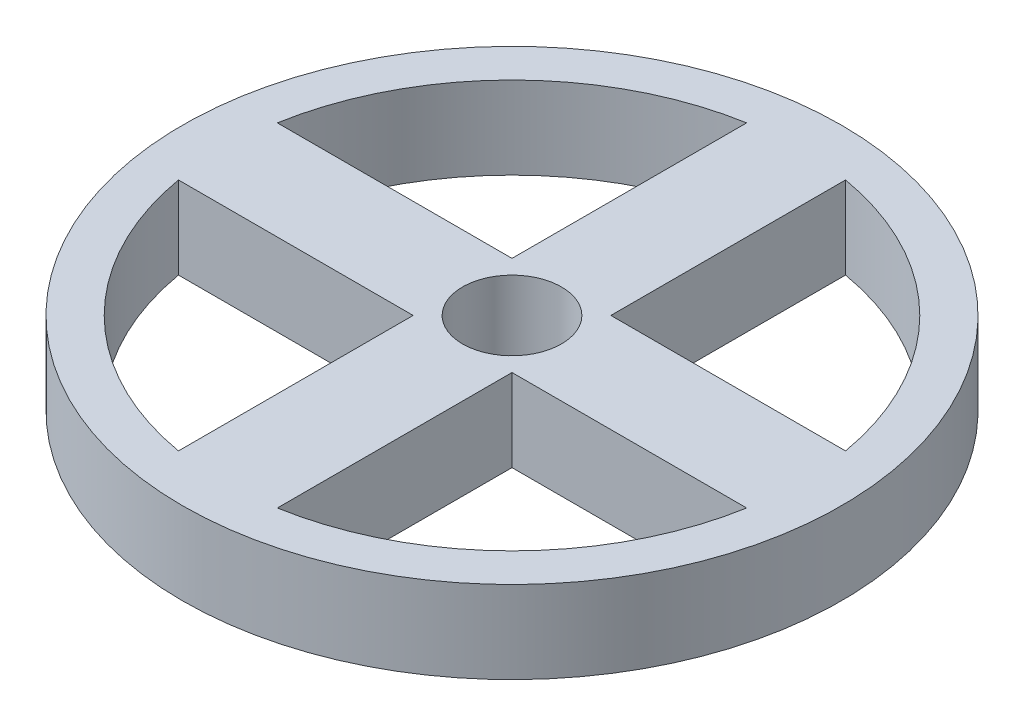
ISO-10303-21;
HEADER;
FILE_DESCRIPTION(('STEP AP214'),'2;1');
FILE_NAME('part.step','',(''),(''),'','','');
FILE_SCHEMA(('AUTOMOTIVE_DESIGN { 1 0 10303 214 1 1 1 1 }'));
ENDSEC;
DATA;
#1=APPLICATION_CONTEXT('core data for automotive mechanical design processes');
#2=APPLICATION_PROTOCOL_DEFINITION('international standard','automotive_design',2000,#1);
#3=PRODUCT_CONTEXT('',#1,'mechanical');
#4=PRODUCT('Part','Part','',(#3));
#5=PRODUCT_RELATED_PRODUCT_CATEGORY('part','',(#4));
#6=PRODUCT_DEFINITION_FORMATION('','',#4);
#7=PRODUCT_DEFINITION_CONTEXT('part definition',#1,'design');
#8=PRODUCT_DEFINITION('design','',#6,#7);
#9=PRODUCT_DEFINITION_SHAPE('','',#8);
#10=(LENGTH_UNIT() NAMED_UNIT(*) SI_UNIT(.MILLI.,.METRE.));
#11=(NAMED_UNIT(*) PLANE_ANGLE_UNIT() SI_UNIT($,.RADIAN.));
#12=(NAMED_UNIT(*) SI_UNIT($,.STERADIAN.) SOLID_ANGLE_UNIT());
#13=UNCERTAINTY_MEASURE_WITH_UNIT(LENGTH_MEASURE(1.E-05),#10,'distance_accuracy_value','');
#14=(GEOMETRIC_REPRESENTATION_CONTEXT(3) GLOBAL_UNCERTAINTY_ASSIGNED_CONTEXT((#13)) GLOBAL_UNIT_ASSIGNED_CONTEXT((#10,
#11,#12)) REPRESENTATION_CONTEXT('',''));
#15=CARTESIAN_POINT('',(0.,0.,0.));
#16=DIRECTION('',(0.,0.,1.));
#17=DIRECTION('',(1.,0.,0.));
#18=AXIS2_PLACEMENT_3D('',#15,#16,#17);
#19=CARTESIAN_POINT('',(0.,10.,0.));
#20=DIRECTION('',(0.,-1.,0.));
#21=DIRECTION('',(0.,0.,-1.));
#22=AXIS2_PLACEMENT_3D('',#19,#20,#21);
#23=CYLINDRICAL_SURFACE('',#22,35.);
#24=CARTESIAN_POINT('',(0.,0.,0.));
#25=DIRECTION('',(0.,1.,0.));
#26=DIRECTION('',(0.,0.,1.));
#27=AXIS2_PLACEMENT_3D('',#24,#25,#26);
#28=CIRCLE('',#27,35.);
#29=CARTESIAN_POINT('',(6.,0.,34.4818792991333));
#30=VERTEX_POINT('',#29);
#31=CARTESIAN_POINT('',(34.4818792991333,0.,6.));
#32=VERTEX_POINT('',#31);
#33=EDGE_CURVE('E140',#30,#32,#28,.T.);
#34=ORIENTED_EDGE('',*,*,#33,.F.);
#35=DIRECTION('',(0.,-1.,0.));
#36=VECTOR('',#35,1.);
#37=CARTESIAN_POINT('',(6.,10.,34.4818792991333));
#38=LINE('',#37,#36);
#39=CARTESIAN_POINT('',(6.,10.,34.4818792991333));
#40=VERTEX_POINT('',#39);
#41=EDGE_CURVE('E11',#40,#30,#38,.T.);
#42=ORIENTED_EDGE('',*,*,#41,.F.);
#43=CARTESIAN_POINT('',(0.,10.,0.));
#44=DIRECTION('',(0.,1.,0.));
#45=DIRECTION('',(0.,0.,1.));
#46=AXIS2_PLACEMENT_3D('',#43,#44,#45);
#47=CIRCLE('',#46,35.);
#48=CARTESIAN_POINT('',(34.4818792991333,10.,6.));
#49=VERTEX_POINT('',#48);
#50=EDGE_CURVE('E138',#40,#49,#47,.T.);
#51=ORIENTED_EDGE('',*,*,#50,.T.);
#52=DIRECTION('',(0.,-1.,0.));
#53=VECTOR('',#52,1.);
#54=CARTESIAN_POINT('',(34.4818792991333,10.,6.));
#55=LINE('',#54,#53);
#56=EDGE_CURVE('E106',#49,#32,#55,.T.);
#57=ORIENTED_EDGE('',*,*,#56,.T.);
#58=EDGE_LOOP('',(#34,#42,#51,#57));
#59=FACE_BOUND('',#58,.T.);
#60=ADVANCED_FACE('F41',(#59),#23,.F.);
#61=CARTESIAN_POINT('',(6.,10.,0.));
#62=DIRECTION('',(1.,0.,0.));
#63=DIRECTION('',(0.,0.,-1.));
#64=AXIS2_PLACEMENT_3D('',#61,#62,#63);
#65=PLANE('',#64);
#66=DIRECTION('',(0.,0.,1.));
#67=VECTOR('',#66,1.);
#68=CARTESIAN_POINT('',(6.,0.,0.));
#69=LINE('',#68,#67);
#70=CARTESIAN_POINT('',(6.,0.,6.));
#71=VERTEX_POINT('',#70);
#72=EDGE_CURVE('E200',#71,#30,#69,.T.);
#73=ORIENTED_EDGE('',*,*,#72,.F.);
#74=DIRECTION('',(0.,-1.,0.));
#75=VECTOR('',#74,1.);
#76=CARTESIAN_POINT('',(6.,10.,6.));
#77=LINE('',#76,#75);
#78=CARTESIAN_POINT('',(6.,10.,6.));
#79=VERTEX_POINT('',#78);
#80=EDGE_CURVE('E52',#79,#71,#77,.T.);
#81=ORIENTED_EDGE('',*,*,#80,.F.);
#82=DIRECTION('',(0.,0.,1.));
#83=VECTOR('',#82,1.);
#84=CARTESIAN_POINT('',(6.,10.,0.));
#85=LINE('',#84,#83);
#86=EDGE_CURVE('E147',#79,#40,#85,.T.);
#87=ORIENTED_EDGE('',*,*,#86,.T.);
#88=ORIENTED_EDGE('',*,*,#41,.T.);
#89=EDGE_LOOP('',(#73,#81,#87,#88));
#90=FACE_BOUND('',#89,.T.);
#91=ADVANCED_FACE('F152',(#90),#65,.T.);
#92=CARTESIAN_POINT('',(0.,10.,-6.));
#93=DIRECTION('',(0.,0.,-1.));
#94=DIRECTION('',(-1.,0.,0.));
#95=AXIS2_PLACEMENT_3D('',#92,#93,#94);
#96=PLANE('',#95);
#97=DIRECTION('',(1.,0.,0.));
#98=VECTOR('',#97,1.);
#99=CARTESIAN_POINT('',(0.,0.,-6.));
#100=LINE('',#99,#98);
#101=CARTESIAN_POINT('',(6.,0.,-6.));
#102=VERTEX_POINT('',#101);
#103=CARTESIAN_POINT('',(34.4818792991333,0.,-6.));
#104=VERTEX_POINT('',#103);
#105=EDGE_CURVE('E191',#102,#104,#100,.T.);
#106=ORIENTED_EDGE('',*,*,#105,.F.);
#107=DIRECTION('',(0.,-1.,0.));
#108=VECTOR('',#107,1.);
#109=CARTESIAN_POINT('',(6.,10.,-6.));
#110=LINE('',#109,#108);
#111=CARTESIAN_POINT('',(6.,10.,-6.));
#112=VERTEX_POINT('',#111);
#113=EDGE_CURVE('E213',#112,#102,#110,.T.);
#114=ORIENTED_EDGE('',*,*,#113,.F.);
#115=DIRECTION('',(1.,0.,0.));
#116=VECTOR('',#115,1.);
#117=CARTESIAN_POINT('',(0.,10.,-6.));
#118=LINE('',#117,#116);
#119=CARTESIAN_POINT('',(34.4818792991333,10.,-6.));
#120=VERTEX_POINT('',#119);
#121=EDGE_CURVE('E265',#112,#120,#118,.T.);
#122=ORIENTED_EDGE('',*,*,#121,.T.);
#123=DIRECTION('',(0.,-1.,0.));
#124=VECTOR('',#123,1.);
#125=CARTESIAN_POINT('',(34.4818792991333,10.,-6.));
#126=LINE('',#125,#124);
#127=EDGE_CURVE('E216',#120,#104,#126,.T.);
#128=ORIENTED_EDGE('',*,*,#127,.T.);
#129=EDGE_LOOP('',(#106,#114,#122,#128));
#130=FACE_BOUND('',#129,.T.);
#131=ADVANCED_FACE('F322',(#130),#96,.T.);
#132=CARTESIAN_POINT('',(6.,10.,0.));
#133=DIRECTION('',(-1.,0.,0.));
#134=DIRECTION('',(0.,0.,1.));
#135=AXIS2_PLACEMENT_3D('',#132,#133,#134);
#136=PLANE('',#135);
#137=DIRECTION('',(0.,0.,-1.));
#138=VECTOR('',#137,1.);
#139=CARTESIAN_POINT('',(6.,0.,0.));
#140=LINE('',#139,#138);
#141=CARTESIAN_POINT('',(6.,0.,-34.4818792991333));
#142=VERTEX_POINT('',#141);
#143=EDGE_CURVE('E195',#102,#142,#140,.T.);
#144=ORIENTED_EDGE('',*,*,#143,.T.);
#145=DIRECTION('',(0.,-1.,0.));
#146=VECTOR('',#145,1.);
#147=CARTESIAN_POINT('',(6.,10.,-34.4818792991333));
#148=LINE('',#147,#146);
#149=CARTESIAN_POINT('',(6.,10.,-34.4818792991333));
#150=VERTEX_POINT('',#149);
#151=EDGE_CURVE('E219',#150,#142,#148,.T.);
#152=ORIENTED_EDGE('',*,*,#151,.F.);
#153=DIRECTION('',(0.,0.,-1.));
#154=VECTOR('',#153,1.);
#155=CARTESIAN_POINT('',(6.,10.,0.));
#156=LINE('',#155,#154);
#157=EDGE_CURVE('E159',#112,#150,#156,.T.);
#158=ORIENTED_EDGE('',*,*,#157,.F.);
#159=ORIENTED_EDGE('',*,*,#113,.T.);
#160=EDGE_LOOP('',(#144,#152,#158,#159));
#161=FACE_BOUND('',#160,.T.);
#162=ADVANCED_FACE('F282',(#161),#136,.F.);
#163=CARTESIAN_POINT('',(-6.,10.,0.));
#164=DIRECTION('',(-1.,0.,0.));
#165=DIRECTION('',(0.,0.,1.));
#166=AXIS2_PLACEMENT_3D('',#163,#164,#165);
#167=PLANE('',#166);
#168=DIRECTION('',(0.,0.,-1.));
#169=VECTOR('',#168,1.);
#170=CARTESIAN_POINT('',(-6.,0.,0.));
#171=LINE('',#170,#169);
#172=CARTESIAN_POINT('',(-6.,0.,-6.));
#173=VERTEX_POINT('',#172);
#174=CARTESIAN_POINT('',(-6.,0.,-34.4818792991333));
#175=VERTEX_POINT('',#174);
#176=EDGE_CURVE('E182',#173,#175,#171,.T.);
#177=ORIENTED_EDGE('',*,*,#176,.F.);
#178=DIRECTION('',(0.,-1.,0.));
#179=VECTOR('',#178,1.);
#180=CARTESIAN_POINT('',(-6.,10.,-6.));
#181=LINE('',#180,#179);
#182=CARTESIAN_POINT('',(-6.,10.,-6.));
#183=VERTEX_POINT('',#182);
#184=EDGE_CURVE('E220',#183,#173,#181,.T.);
#185=ORIENTED_EDGE('',*,*,#184,.F.);
#186=DIRECTION('',(0.,0.,-1.));
#187=VECTOR('',#186,1.);
#188=CARTESIAN_POINT('',(-6.,10.,0.));
#189=LINE('',#188,#187);
#190=CARTESIAN_POINT('',(-6.,10.,-34.4818792991333));
#191=VERTEX_POINT('',#190);
#192=EDGE_CURVE('E255',#183,#191,#189,.T.);
#193=ORIENTED_EDGE('',*,*,#192,.T.);
#194=DIRECTION('',(0.,-1.,0.));
#195=VECTOR('',#194,1.);
#196=CARTESIAN_POINT('',(-6.,10.,-34.4818792991333));
#197=LINE('',#196,#195);
#198=EDGE_CURVE('E225',#191,#175,#197,.T.);
#199=ORIENTED_EDGE('',*,*,#198,.T.);
#200=EDGE_LOOP('',(#177,#185,#193,#199));
#201=FACE_BOUND('',#200,.T.);
#202=ADVANCED_FACE('F302',(#201),#167,.T.);
#203=CARTESIAN_POINT('',(0.,10.,-6.));
#204=DIRECTION('',(0.,0.,1.));
#205=DIRECTION('',(1.,0.,0.));
#206=AXIS2_PLACEMENT_3D('',#203,#204,#205);
#207=PLANE('',#206);
#208=DIRECTION('',(-1.,0.,0.));
#209=VECTOR('',#208,1.);
#210=CARTESIAN_POINT('',(0.,0.,-6.));
#211=LINE('',#210,#209);
#212=CARTESIAN_POINT('',(-34.4818792991333,0.,-6.));
#213=VERTEX_POINT('',#212);
#214=EDGE_CURVE('E187',#173,#213,#211,.T.);
#215=ORIENTED_EDGE('',*,*,#214,.T.);
#216=DIRECTION('',(0.,-1.,0.));
#217=VECTOR('',#216,1.);
#218=CARTESIAN_POINT('',(-34.4818792991333,10.,-6.));
#219=LINE('',#218,#217);
#220=CARTESIAN_POINT('',(-34.4818792991333,10.,-6.));
#221=VERTEX_POINT('',#220);
#222=EDGE_CURVE('E228',#221,#213,#219,.T.);
#223=ORIENTED_EDGE('',*,*,#222,.F.);
#224=DIRECTION('',(-1.,0.,0.));
#225=VECTOR('',#224,1.);
#226=CARTESIAN_POINT('',(0.,10.,-6.));
#227=LINE('',#226,#225);
#228=EDGE_CURVE('E260',#183,#221,#227,.T.);
#229=ORIENTED_EDGE('',*,*,#228,.F.);
#230=ORIENTED_EDGE('',*,*,#184,.T.);
#231=EDGE_LOOP('',(#215,#223,#229,#230));
#232=FACE_BOUND('',#231,.T.);
#233=ADVANCED_FACE('F299',(#232),#207,.F.);
#234=CARTESIAN_POINT('',(0.,10.,6.));
#235=DIRECTION('',(0.,0.,1.));
#236=DIRECTION('',(1.,0.,0.));
#237=AXIS2_PLACEMENT_3D('',#234,#235,#236);
#238=PLANE('',#237);
#239=DIRECTION('',(-1.,0.,0.));
#240=VECTOR('',#239,1.);
#241=CARTESIAN_POINT('',(0.,0.,6.));
#242=LINE('',#241,#240);
#243=CARTESIAN_POINT('',(-6.,0.,6.));
#244=VERTEX_POINT('',#243);
#245=CARTESIAN_POINT('',(-34.4818792991333,0.,6.));
#246=VERTEX_POINT('',#245);
#247=EDGE_CURVE('E170',#244,#246,#242,.T.);
#248=ORIENTED_EDGE('',*,*,#247,.F.);
#249=DIRECTION('',(0.,-1.,0.));
#250=VECTOR('',#249,1.);
#251=CARTESIAN_POINT('',(-6.,10.,6.));
#252=LINE('',#251,#250);
#253=CARTESIAN_POINT('',(-6.,10.,6.));
#254=VERTEX_POINT('',#253);
#255=EDGE_CURVE('E45',#254,#244,#252,.T.);
#256=ORIENTED_EDGE('',*,*,#255,.F.);
#257=DIRECTION('',(-1.,0.,0.));
#258=VECTOR('',#257,1.);
#259=CARTESIAN_POINT('',(0.,10.,6.));
#260=LINE('',#259,#258);
#261=CARTESIAN_POINT('',(-34.4818792991333,10.,6.));
#262=VERTEX_POINT('',#261);
#263=EDGE_CURVE('E250',#254,#262,#260,.T.);
#264=ORIENTED_EDGE('',*,*,#263,.T.);
#265=DIRECTION('',(0.,-1.,0.));
#266=VECTOR('',#265,1.);
#267=CARTESIAN_POINT('',(-34.4818792991333,10.,6.));
#268=LINE('',#267,#266);
#269=EDGE_CURVE('E165',#262,#246,#268,.T.);
#270=ORIENTED_EDGE('',*,*,#269,.T.);
#271=EDGE_LOOP('',(#248,#256,#264,#270));
#272=FACE_BOUND('',#271,.T.);
#273=ADVANCED_FACE('F249',(#272),#238,.T.);
#274=CARTESIAN_POINT('',(-6.,10.,0.));
#275=DIRECTION('',(1.,0.,0.));
#276=DIRECTION('',(0.,0.,-1.));
#277=AXIS2_PLACEMENT_3D('',#274,#275,#276);
#278=PLANE('',#277);
#279=DIRECTION('',(0.,0.,1.));
#280=VECTOR('',#279,1.);
#281=CARTESIAN_POINT('',(-6.,0.,0.));
#282=LINE('',#281,#280);
#283=CARTESIAN_POINT('',(-6.,0.,34.4818792991333));
#284=VERTEX_POINT('',#283);
#285=EDGE_CURVE('E174',#244,#284,#282,.T.);
#286=ORIENTED_EDGE('',*,*,#285,.T.);
#287=DIRECTION('',(0.,-1.,0.));
#288=VECTOR('',#287,1.);
#289=CARTESIAN_POINT('',(-6.,10.,34.4818792991333));
#290=LINE('',#289,#288);
#291=CARTESIAN_POINT('',(-6.,10.,34.4818792991333));
#292=VERTEX_POINT('',#291);
#293=EDGE_CURVE('E234',#292,#284,#290,.T.);
#294=ORIENTED_EDGE('',*,*,#293,.F.);
#295=DIRECTION('',(0.,0.,1.));
#296=VECTOR('',#295,1.);
#297=CARTESIAN_POINT('',(-6.,10.,0.));
#298=LINE('',#297,#296);
#299=EDGE_CURVE('E244',#254,#292,#298,.T.);
#300=ORIENTED_EDGE('',*,*,#299,.F.);
#301=ORIENTED_EDGE('',*,*,#255,.T.);
#302=EDGE_LOOP('',(#286,#294,#300,#301));
#303=FACE_BOUND('',#302,.T.);
#304=ADVANCED_FACE('F243',(#303),#278,.F.);
#305=CARTESIAN_POINT('',(0.,10.,6.));
#306=DIRECTION('',(0.,0.,-1.));
#307=DIRECTION('',(-1.,0.,0.));
#308=AXIS2_PLACEMENT_3D('',#305,#306,#307);
#309=PLANE('',#308);
#310=DIRECTION('',(1.,0.,0.));
#311=VECTOR('',#310,1.);
#312=CARTESIAN_POINT('',(0.,0.,6.));
#313=LINE('',#312,#311);
#314=EDGE_CURVE('E203',#71,#32,#313,.T.);
#315=ORIENTED_EDGE('',*,*,#314,.T.);
#316=ORIENTED_EDGE('',*,*,#56,.F.);
#317=DIRECTION('',(1.,0.,0.));
#318=VECTOR('',#317,1.);
#319=CARTESIAN_POINT('',(0.,10.,6.));
#320=LINE('',#319,#318);
#321=EDGE_CURVE('E61',#79,#49,#320,.T.);
#322=ORIENTED_EDGE('',*,*,#321,.F.);
#323=ORIENTED_EDGE('',*,*,#80,.T.);
#324=EDGE_LOOP('',(#315,#316,#322,#323));
#325=FACE_BOUND('',#324,.T.);
#326=ADVANCED_FACE('F327',(#325),#309,.F.);
#327=EDGE_CURVE('E199',#104,#142,#28,.T.);
#328=ORIENTED_EDGE('',*,*,#327,.F.);
#329=ORIENTED_EDGE('',*,*,#127,.F.);
#330=EDGE_CURVE('E149',#120,#150,#47,.T.);
#331=ORIENTED_EDGE('',*,*,#330,.T.);
#332=ORIENTED_EDGE('',*,*,#151,.T.);
#333=EDGE_LOOP('',(#328,#329,#331,#332));
#334=FACE_BOUND('',#333,.T.);
#335=ADVANCED_FACE('F286',(#334),#23,.F.);
#336=EDGE_CURVE('E183',#175,#213,#28,.T.);
#337=ORIENTED_EDGE('',*,*,#336,.F.);
#338=ORIENTED_EDGE('',*,*,#198,.F.);
#339=EDGE_CURVE('E256',#191,#221,#47,.T.);
#340=ORIENTED_EDGE('',*,*,#339,.T.);
#341=ORIENTED_EDGE('',*,*,#222,.T.);
#342=EDGE_LOOP('',(#337,#338,#340,#341));
#343=FACE_BOUND('',#342,.T.);
#344=ADVANCED_FACE('F295',(#343),#23,.F.);
#345=EDGE_CURVE('E178',#246,#284,#28,.T.);
#346=ORIENTED_EDGE('',*,*,#345,.F.);
#347=ORIENTED_EDGE('',*,*,#269,.F.);
#348=EDGE_CURVE('E151',#262,#292,#47,.T.);
#349=ORIENTED_EDGE('',*,*,#348,.T.);
#350=ORIENTED_EDGE('',*,*,#293,.T.);
#351=EDGE_LOOP('',(#346,#347,#349,#350));
#352=FACE_BOUND('',#351,.T.);
#353=ADVANCED_FACE('F252',(#352),#23,.F.);
#354=CARTESIAN_POINT('',(0.,10.,0.));
#355=DIRECTION('',(0.,-1.,0.));
#356=DIRECTION('',(0.,0.,-1.));
#357=AXIS2_PLACEMENT_3D('',#354,#355,#356);
#358=CYLINDRICAL_SURFACE('',#357,6.);
#359=CARTESIAN_POINT('',(0.,10.,0.));
#360=DIRECTION('',(0.,1.,0.));
#361=DIRECTION('',(0.,0.,1.));
#362=AXIS2_PLACEMENT_3D('',#359,#360,#361);
#363=CIRCLE('',#362,6.);
#364=CARTESIAN_POINT('',(0.,10.,6.));
#365=VERTEX_POINT('',#364);
#366=EDGE_CURVE('E210',#365,#365,#363,.T.);
#367=ORIENTED_EDGE('',*,*,#366,.T.);
#368=EDGE_LOOP('',(#367));
#369=FACE_BOUND('',#368,.T.);
#370=CARTESIAN_POINT('',(0.,0.,0.));
#371=DIRECTION('',(0.,1.,0.));
#372=DIRECTION('',(0.,0.,1.));
#373=AXIS2_PLACEMENT_3D('',#370,#371,#372);
#374=CIRCLE('',#373,6.);
#375=CARTESIAN_POINT('',(0.,0.,6.));
#376=VERTEX_POINT('',#375);
#377=EDGE_CURVE('E166',#376,#376,#374,.T.);
#378=ORIENTED_EDGE('',*,*,#377,.F.);
#379=EDGE_LOOP('',(#378));
#380=FACE_BOUND('',#379,.T.);
#381=ADVANCED_FACE('F43',(#369,#380),#358,.F.);
#382=CARTESIAN_POINT('',(0.,10.,0.));
#383=DIRECTION('',(0.,-1.,0.));
#384=DIRECTION('',(0.,0.,-1.));
#385=AXIS2_PLACEMENT_3D('',#382,#383,#384);
#386=CYLINDRICAL_SURFACE('',#385,40.);
#387=CARTESIAN_POINT('',(0.,10.,0.));
#388=DIRECTION('',(0.,1.,0.));
#389=DIRECTION('',(0.,0.,1.));
#390=AXIS2_PLACEMENT_3D('',#387,#388,#389);
#391=CIRCLE('',#390,40.);
#392=CARTESIAN_POINT('',(0.,10.,40.));
#393=VERTEX_POINT('',#392);
#394=EDGE_CURVE('E156',#393,#393,#391,.T.);
#395=ORIENTED_EDGE('',*,*,#394,.F.);
#396=EDGE_LOOP('',(#395));
#397=FACE_BOUND('',#396,.T.);
#398=CARTESIAN_POINT('',(0.,0.,0.));
#399=DIRECTION('',(0.,1.,0.));
#400=DIRECTION('',(0.,0.,1.));
#401=AXIS2_PLACEMENT_3D('',#398,#399,#400);
#402=CIRCLE('',#401,40.);
#403=CARTESIAN_POINT('',(0.,0.,40.));
#404=VERTEX_POINT('',#403);
#405=EDGE_CURVE('E206',#404,#404,#402,.T.);
#406=ORIENTED_EDGE('',*,*,#405,.T.);
#407=EDGE_LOOP('',(#406));
#408=FACE_BOUND('',#407,.T.);
#409=ADVANCED_FACE('F305',(#397,#408),#386,.T.);
#410=CARTESIAN_POINT('',(0.,10.,0.));
#411=DIRECTION('',(0.,1.,0.));
#412=DIRECTION('',(0.,0.,1.));
#413=AXIS2_PLACEMENT_3D('',#410,#411,#412);
#414=PLANE('',#413);
#415=ORIENTED_EDGE('',*,*,#366,.F.);
#416=EDGE_LOOP('',(#415));
#417=FACE_BOUND('',#416,.T.);
#418=ORIENTED_EDGE('',*,*,#263,.F.);
#419=ORIENTED_EDGE('',*,*,#299,.T.);
#420=ORIENTED_EDGE('',*,*,#348,.F.);
#421=EDGE_LOOP('',(#418,#419,#420));
#422=FACE_BOUND('',#421,.T.);
#423=ORIENTED_EDGE('',*,*,#192,.F.);
#424=ORIENTED_EDGE('',*,*,#228,.T.);
#425=ORIENTED_EDGE('',*,*,#339,.F.);
#426=EDGE_LOOP('',(#423,#424,#425));
#427=FACE_BOUND('',#426,.T.);
#428=ORIENTED_EDGE('',*,*,#121,.F.);
#429=ORIENTED_EDGE('',*,*,#157,.T.);
#430=ORIENTED_EDGE('',*,*,#330,.F.);
#431=EDGE_LOOP('',(#428,#429,#430));
#432=FACE_BOUND('',#431,.T.);
#433=ORIENTED_EDGE('',*,*,#50,.F.);
#434=ORIENTED_EDGE('',*,*,#86,.F.);
#435=ORIENTED_EDGE('',*,*,#321,.T.);
#436=EDGE_LOOP('',(#433,#434,#435));
#437=FACE_BOUND('',#436,.T.);
#438=ORIENTED_EDGE('',*,*,#394,.T.);
#439=EDGE_LOOP('',(#438));
#440=FACE_BOUND('',#439,.T.);
#441=ADVANCED_FACE('F145',(#417,#422,#427,#432,#437,#440),#414,.T.);
#442=CARTESIAN_POINT('',(0.,0.,0.));
#443=DIRECTION('',(0.,1.,0.));
#444=DIRECTION('',(0.,0.,1.));
#445=AXIS2_PLACEMENT_3D('',#442,#443,#444);
#446=PLANE('',#445);
#447=ORIENTED_EDGE('',*,*,#377,.T.);
#448=EDGE_LOOP('',(#447));
#449=FACE_BOUND('',#448,.T.);
#450=ORIENTED_EDGE('',*,*,#247,.T.);
#451=ORIENTED_EDGE('',*,*,#345,.T.);
#452=ORIENTED_EDGE('',*,*,#285,.F.);
#453=EDGE_LOOP('',(#450,#451,#452));
#454=FACE_BOUND('',#453,.T.);
#455=ORIENTED_EDGE('',*,*,#176,.T.);
#456=ORIENTED_EDGE('',*,*,#336,.T.);
#457=ORIENTED_EDGE('',*,*,#214,.F.);
#458=EDGE_LOOP('',(#455,#456,#457));
#459=FACE_BOUND('',#458,.T.);
#460=ORIENTED_EDGE('',*,*,#105,.T.);
#461=ORIENTED_EDGE('',*,*,#327,.T.);
#462=ORIENTED_EDGE('',*,*,#143,.F.);
#463=EDGE_LOOP('',(#460,#461,#462));
#464=FACE_BOUND('',#463,.T.);
#465=ORIENTED_EDGE('',*,*,#33,.T.);
#466=ORIENTED_EDGE('',*,*,#314,.F.);
#467=ORIENTED_EDGE('',*,*,#72,.T.);
#468=EDGE_LOOP('',(#465,#466,#467));
#469=FACE_BOUND('',#468,.T.);
#470=ORIENTED_EDGE('',*,*,#405,.F.);
#471=EDGE_LOOP('',(#470));
#472=FACE_BOUND('',#471,.T.);
#473=ADVANCED_FACE('F247',(#449,#454,#459,#464,#469,#472),#446,.F.);
#474=CLOSED_SHELL('',(#60,#91,#131,#162,#202,#233,#273,#304,#326,#335,#344,#353,#381,#409,#441,#473));
#475=MANIFOLD_SOLID_BREP('B2',#474);
#476=ADVANCED_BREP_SHAPE_REPRESENTATION('',(#18,#475),#14);
#477=SHAPE_DEFINITION_REPRESENTATION(#9,#476);
ENDSEC;
END-ISO-10303-21;
